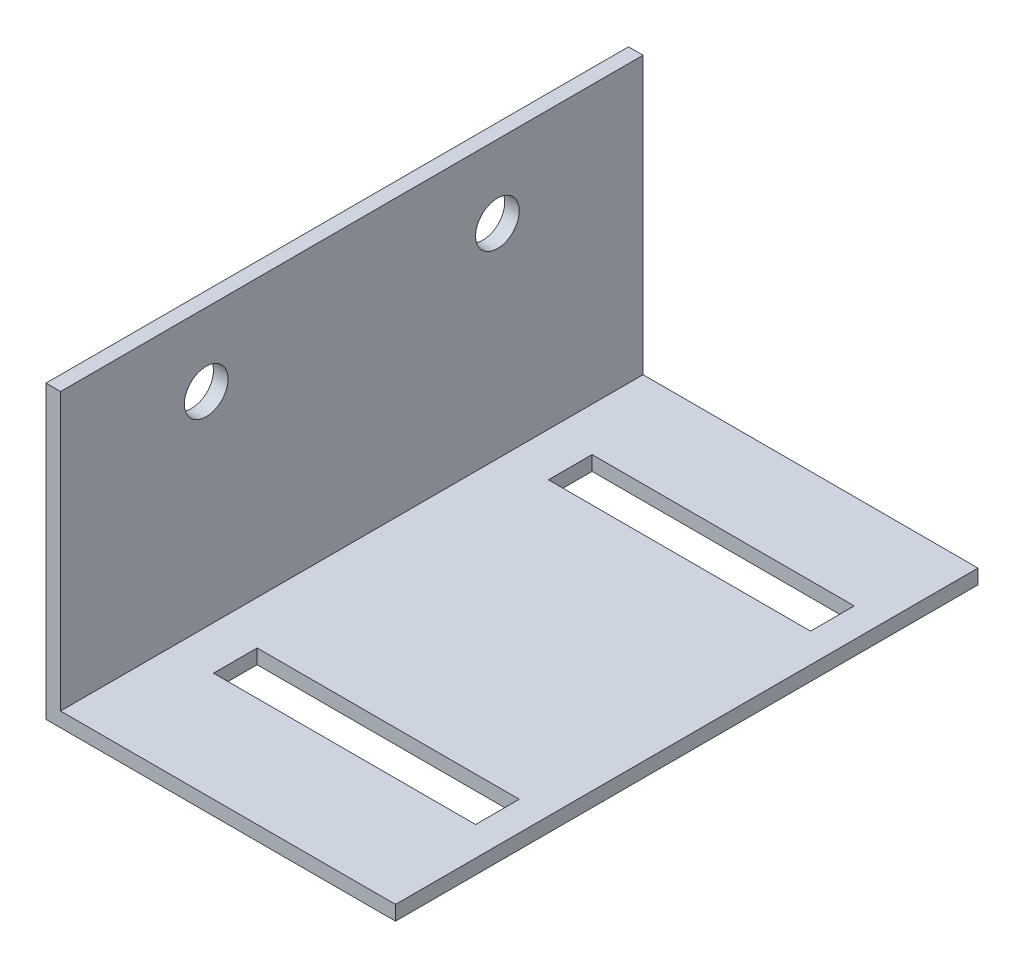
ISO-10303-21;
HEADER;
FILE_DESCRIPTION(('STEP AP214'),'2;1');
FILE_NAME('part.step','',(''),(''),'','','');
FILE_SCHEMA(('AUTOMOTIVE_DESIGN { 1 0 10303 214 1 1 1 1 }'));
ENDSEC;
DATA;
#1=APPLICATION_CONTEXT('core data for automotive mechanical design processes');
#2=APPLICATION_PROTOCOL_DEFINITION('international standard','automotive_design',2000,#1);
#3=PRODUCT_CONTEXT('',#1,'mechanical');
#4=PRODUCT('Part','Part','',(#3));
#5=PRODUCT_RELATED_PRODUCT_CATEGORY('part','',(#4));
#6=PRODUCT_DEFINITION_FORMATION('','',#4);
#7=PRODUCT_DEFINITION_CONTEXT('part definition',#1,'design');
#8=PRODUCT_DEFINITION('design','',#6,#7);
#9=PRODUCT_DEFINITION_SHAPE('','',#8);
#10=(LENGTH_UNIT() NAMED_UNIT(*) SI_UNIT(.MILLI.,.METRE.));
#11=(NAMED_UNIT(*) PLANE_ANGLE_UNIT() SI_UNIT($,.RADIAN.));
#12=(NAMED_UNIT(*) SI_UNIT($,.STERADIAN.) SOLID_ANGLE_UNIT());
#13=UNCERTAINTY_MEASURE_WITH_UNIT(LENGTH_MEASURE(1.E-05),#10,'distance_accuracy_value','');
#14=(GEOMETRIC_REPRESENTATION_CONTEXT(3) GLOBAL_UNCERTAINTY_ASSIGNED_CONTEXT((#13)) GLOBAL_UNIT_ASSIGNED_CONTEXT((#10,
#11,#12)) REPRESENTATION_CONTEXT('',''));
#15=CARTESIAN_POINT('',(0.,0.,0.));
#16=DIRECTION('',(0.,0.,1.));
#17=DIRECTION('',(1.,0.,0.));
#18=AXIS2_PLACEMENT_3D('',#15,#16,#17);
#19=CARTESIAN_POINT('',(0.,20.,40.));
#20=DIRECTION('',(1.,0.,0.));
#21=DIRECTION('',(0.,1.,0.));
#22=AXIS2_PLACEMENT_3D('',#19,#20,#21);
#23=PLANE('',#22);
#24=CARTESIAN_POINT('',(0.,15.,30.));
#25=DIRECTION('',(-1.,0.,0.));
#26=DIRECTION('',(0.,-1.,0.));
#27=AXIS2_PLACEMENT_3D('',#24,#25,#26);
#28=CIRCLE('',#27,1.5);
#29=CARTESIAN_POINT('',(0.,13.5,30.));
#30=VERTEX_POINT('',#29);
#31=EDGE_CURVE('E249',#30,#30,#28,.T.);
#32=ORIENTED_EDGE('',*,*,#31,.F.);
#33=EDGE_LOOP('',(#32));
#34=FACE_BOUND('',#33,.T.);
#35=CARTESIAN_POINT('',(0.,15.,10.));
#36=DIRECTION('',(-1.,0.,0.));
#37=DIRECTION('',(0.,-1.,0.));
#38=AXIS2_PLACEMENT_3D('',#35,#36,#37);
#39=CIRCLE('',#38,1.5);
#40=CARTESIAN_POINT('',(0.,13.5,10.));
#41=VERTEX_POINT('',#40);
#42=EDGE_CURVE('E254',#41,#41,#39,.T.);
#43=ORIENTED_EDGE('',*,*,#42,.F.);
#44=EDGE_LOOP('',(#43));
#45=FACE_BOUND('',#44,.T.);
#46=DIRECTION('',(0.,-1.,0.));
#47=VECTOR('',#46,1.);
#48=CARTESIAN_POINT('',(0.,20.,0.));
#49=LINE('',#48,#47);
#50=CARTESIAN_POINT('',(0.,20.,0.));
#51=VERTEX_POINT('',#50);
#52=CARTESIAN_POINT('',(0.,0.,0.));
#53=VERTEX_POINT('',#52);
#54=EDGE_CURVE('E208',#51,#53,#49,.T.);
#55=ORIENTED_EDGE('',*,*,#54,.T.);
#56=DIRECTION('',(0.,0.,-1.));
#57=VECTOR('',#56,1.);
#58=CARTESIAN_POINT('',(0.,0.,40.));
#59=LINE('',#58,#57);
#60=CARTESIAN_POINT('',(0.,0.,40.));
#61=VERTEX_POINT('',#60);
#62=EDGE_CURVE('E11',#61,#53,#59,.T.);
#63=ORIENTED_EDGE('',*,*,#62,.F.);
#64=DIRECTION('',(0.,-1.,0.));
#65=VECTOR('',#64,1.);
#66=CARTESIAN_POINT('',(0.,20.,40.));
#67=LINE('',#66,#65);
#68=CARTESIAN_POINT('',(0.,20.,40.));
#69=VERTEX_POINT('',#68);
#70=EDGE_CURVE('E209',#69,#61,#67,.T.);
#71=ORIENTED_EDGE('',*,*,#70,.F.);
#72=DIRECTION('',(0.,0.,-1.));
#73=VECTOR('',#72,1.);
#74=CARTESIAN_POINT('',(0.,20.,40.));
#75=LINE('',#74,#73);
#76=EDGE_CURVE('E223',#69,#51,#75,.T.);
#77=ORIENTED_EDGE('',*,*,#76,.T.);
#78=EDGE_LOOP('',(#55,#63,#71,#77));
#79=FACE_BOUND('',#78,.T.);
#80=ADVANCED_FACE('F36',(#34,#45,#79),#23,.F.);
#81=CARTESIAN_POINT('',(0.,0.,40.));
#82=DIRECTION('',(0.,1.,0.));
#83=DIRECTION('',(0.,0.,1.));
#84=AXIS2_PLACEMENT_3D('',#81,#82,#83);
#85=PLANE('',#84);
#86=DIRECTION('',(-1.,0.,0.));
#87=VECTOR('',#86,1.);
#88=CARTESIAN_POINT('',(0.,0.,6.50000000000001));
#89=LINE('',#88,#87);
#90=CARTESIAN_POINT('',(22.,0.,6.50000000000001));
#91=VERTEX_POINT('',#90);
#92=CARTESIAN_POINT('',(4.00000000000001,0.,6.50000000000001));
#93=VERTEX_POINT('',#92);
#94=EDGE_CURVE('E202',#91,#93,#89,.T.);
#95=ORIENTED_EDGE('',*,*,#94,.T.);
#96=DIRECTION('',(0.,0.,1.));
#97=VECTOR('',#96,1.);
#98=CARTESIAN_POINT('',(4.00000000000003,0.,40.));
#99=LINE('',#98,#97);
#100=CARTESIAN_POINT('',(4.00000000000001,0.,9.50000000000001));
#101=VERTEX_POINT('',#100);
#102=EDGE_CURVE('E205',#93,#101,#99,.T.);
#103=ORIENTED_EDGE('',*,*,#102,.T.);
#104=DIRECTION('',(1.,0.,0.));
#105=VECTOR('',#104,1.);
#106=CARTESIAN_POINT('',(0.,0.,9.50000000000002));
#107=LINE('',#106,#105);
#108=CARTESIAN_POINT('',(22.,0.,9.50000000000002));
#109=VERTEX_POINT('',#108);
#110=EDGE_CURVE('E199',#101,#109,#107,.T.);
#111=ORIENTED_EDGE('',*,*,#110,.T.);
#112=DIRECTION('',(0.,0.,-1.));
#113=VECTOR('',#112,1.);
#114=CARTESIAN_POINT('',(22.,0.,40.));
#115=LINE('',#114,#113);
#116=EDGE_CURVE('E143',#109,#91,#115,.T.);
#117=ORIENTED_EDGE('',*,*,#116,.T.);
#118=EDGE_LOOP('',(#95,#103,#111,#117));
#119=FACE_BOUND('',#118,.T.);
#120=DIRECTION('',(-1.,0.,0.));
#121=VECTOR('',#120,1.);
#122=CARTESIAN_POINT('',(0.,0.,29.5));
#123=LINE('',#122,#121);
#124=CARTESIAN_POINT('',(22.,0.,29.5));
#125=VERTEX_POINT('',#124);
#126=CARTESIAN_POINT('',(4.00000000000001,0.,29.5));
#127=VERTEX_POINT('',#126);
#128=EDGE_CURVE('E193',#125,#127,#123,.T.);
#129=ORIENTED_EDGE('',*,*,#128,.T.);
#130=DIRECTION('',(0.,0.,1.));
#131=VECTOR('',#130,1.);
#132=CARTESIAN_POINT('',(4.00000000000001,0.,40.));
#133=LINE('',#132,#131);
#134=CARTESIAN_POINT('',(4.00000000000001,0.,32.5));
#135=VERTEX_POINT('',#134);
#136=EDGE_CURVE('E196',#127,#135,#133,.T.);
#137=ORIENTED_EDGE('',*,*,#136,.T.);
#138=DIRECTION('',(1.,0.,0.));
#139=VECTOR('',#138,1.);
#140=CARTESIAN_POINT('',(0.,0.,32.5));
#141=LINE('',#140,#139);
#142=CARTESIAN_POINT('',(22.,0.,32.5));
#143=VERTEX_POINT('',#142);
#144=EDGE_CURVE('E167',#135,#143,#141,.T.);
#145=ORIENTED_EDGE('',*,*,#144,.T.);
#146=DIRECTION('',(0.,0.,-1.));
#147=VECTOR('',#146,1.);
#148=CARTESIAN_POINT('',(22.,0.,40.));
#149=LINE('',#148,#147);
#150=EDGE_CURVE('E190',#143,#125,#149,.T.);
#151=ORIENTED_EDGE('',*,*,#150,.T.);
#152=EDGE_LOOP('',(#129,#137,#145,#151));
#153=FACE_BOUND('',#152,.T.);
#154=DIRECTION('',(1.,0.,0.));
#155=VECTOR('',#154,1.);
#156=CARTESIAN_POINT('',(0.,0.,0.));
#157=LINE('',#156,#155);
#158=CARTESIAN_POINT('',(24.,0.,0.));
#159=VERTEX_POINT('',#158);
#160=EDGE_CURVE('E226',#53,#159,#157,.T.);
#161=ORIENTED_EDGE('',*,*,#160,.T.);
#162=DIRECTION('',(0.,0.,-1.));
#163=VECTOR('',#162,1.);
#164=CARTESIAN_POINT('',(24.,0.,40.));
#165=LINE('',#164,#163);
#166=CARTESIAN_POINT('',(24.,0.,40.));
#167=VERTEX_POINT('',#166);
#168=EDGE_CURVE('E44',#167,#159,#165,.T.);
#169=ORIENTED_EDGE('',*,*,#168,.F.);
#170=DIRECTION('',(1.,0.,0.));
#171=VECTOR('',#170,1.);
#172=CARTESIAN_POINT('',(0.,0.,40.));
#173=LINE('',#172,#171);
#174=EDGE_CURVE('E212',#61,#167,#173,.T.);
#175=ORIENTED_EDGE('',*,*,#174,.F.);
#176=ORIENTED_EDGE('',*,*,#62,.T.);
#177=EDGE_LOOP('',(#161,#169,#175,#176));
#178=FACE_BOUND('',#177,.T.);
#179=ADVANCED_FACE('F266',(#119,#153,#178),#85,.F.);
#180=CARTESIAN_POINT('',(24.,0.,40.));
#181=DIRECTION('',(-1.,0.,0.));
#182=DIRECTION('',(0.,0.,1.));
#183=AXIS2_PLACEMENT_3D('',#180,#181,#182);
#184=PLANE('',#183);
#185=DIRECTION('',(0.,1.,0.));
#186=VECTOR('',#185,1.);
#187=CARTESIAN_POINT('',(24.,0.,0.));
#188=LINE('',#187,#186);
#189=CARTESIAN_POINT('',(24.,0.999999999999995,0.));
#190=VERTEX_POINT('',#189);
#191=EDGE_CURVE('E228',#159,#190,#188,.T.);
#192=ORIENTED_EDGE('',*,*,#191,.T.);
#193=DIRECTION('',(0.,0.,-1.));
#194=VECTOR('',#193,1.);
#195=CARTESIAN_POINT('',(24.,0.999999999999995,40.));
#196=LINE('',#195,#194);
#197=CARTESIAN_POINT('',(24.,0.999999999999995,40.));
#198=VERTEX_POINT('',#197);
#199=EDGE_CURVE('E243',#198,#190,#196,.T.);
#200=ORIENTED_EDGE('',*,*,#199,.F.);
#201=DIRECTION('',(0.,1.,0.));
#202=VECTOR('',#201,1.);
#203=CARTESIAN_POINT('',(24.,0.,40.));
#204=LINE('',#203,#202);
#205=EDGE_CURVE('E215',#167,#198,#204,.T.);
#206=ORIENTED_EDGE('',*,*,#205,.F.);
#207=ORIENTED_EDGE('',*,*,#168,.T.);
#208=EDGE_LOOP('',(#192,#200,#206,#207));
#209=FACE_BOUND('',#208,.T.);
#210=ADVANCED_FACE('F269',(#209),#184,.F.);
#211=CARTESIAN_POINT('',(24.,0.999999999999995,40.));
#212=DIRECTION('',(0.,-1.,0.));
#213=DIRECTION('',(1.,0.,0.));
#214=AXIS2_PLACEMENT_3D('',#211,#212,#213);
#215=PLANE('',#214);
#216=DIRECTION('',(1.,0.,0.));
#217=VECTOR('',#216,1.);
#218=CARTESIAN_POINT('',(4.00000000000001,1.,9.50000000000001));
#219=LINE('',#218,#217);
#220=CARTESIAN_POINT('',(4.00000000000001,0.999999999999999,9.50000000000002));
#221=VERTEX_POINT('',#220);
#222=CARTESIAN_POINT('',(22.,1.,9.50000000000002));
#223=VERTEX_POINT('',#222);
#224=EDGE_CURVE('E150',#221,#223,#219,.T.);
#225=ORIENTED_EDGE('',*,*,#224,.F.);
#226=DIRECTION('',(0.,0.,1.));
#227=VECTOR('',#226,1.);
#228=CARTESIAN_POINT('',(4.00000000000001,1.,6.50000000000001));
#229=LINE('',#228,#227);
#230=CARTESIAN_POINT('',(4.00000000000001,1.,6.50000000000001));
#231=VERTEX_POINT('',#230);
#232=EDGE_CURVE('E155',#231,#221,#229,.T.);
#233=ORIENTED_EDGE('',*,*,#232,.F.);
#234=DIRECTION('',(-1.,0.,0.));
#235=VECTOR('',#234,1.);
#236=CARTESIAN_POINT('',(4.00000000000001,1.,6.50000000000001));
#237=LINE('',#236,#235);
#238=CARTESIAN_POINT('',(22.,1.,6.50000000000001));
#239=VERTEX_POINT('',#238);
#240=EDGE_CURVE('E160',#239,#231,#237,.T.);
#241=ORIENTED_EDGE('',*,*,#240,.F.);
#242=DIRECTION('',(0.,0.,-1.));
#243=VECTOR('',#242,1.);
#244=CARTESIAN_POINT('',(22.,1.,6.50000000000001));
#245=LINE('',#244,#243);
#246=EDGE_CURVE('E140',#223,#239,#245,.T.);
#247=ORIENTED_EDGE('',*,*,#246,.F.);
#248=EDGE_LOOP('',(#225,#233,#241,#247));
#249=FACE_BOUND('',#248,.T.);
#250=DIRECTION('',(1.,0.,0.));
#251=VECTOR('',#250,1.);
#252=CARTESIAN_POINT('',(4.00000000000001,1.,32.5));
#253=LINE('',#252,#251);
#254=CARTESIAN_POINT('',(4.00000000000001,0.999999999999999,32.5));
#255=VERTEX_POINT('',#254);
#256=CARTESIAN_POINT('',(22.,1.,32.5));
#257=VERTEX_POINT('',#256);
#258=EDGE_CURVE('E172',#255,#257,#253,.T.);
#259=ORIENTED_EDGE('',*,*,#258,.F.);
#260=DIRECTION('',(0.,0.,1.));
#261=VECTOR('',#260,1.);
#262=CARTESIAN_POINT('',(4.00000000000001,1.,32.5));
#263=LINE('',#262,#261);
#264=CARTESIAN_POINT('',(4.00000000000001,1.,29.5));
#265=VERTEX_POINT('',#264);
#266=EDGE_CURVE('E170',#265,#255,#263,.T.);
#267=ORIENTED_EDGE('',*,*,#266,.F.);
#268=DIRECTION('',(-1.,0.,0.));
#269=VECTOR('',#268,1.);
#270=CARTESIAN_POINT('',(4.00000000000001,1.,29.5));
#271=LINE('',#270,#269);
#272=CARTESIAN_POINT('',(22.,1.,29.5));
#273=VERTEX_POINT('',#272);
#274=EDGE_CURVE('E177',#273,#265,#271,.T.);
#275=ORIENTED_EDGE('',*,*,#274,.F.);
#276=DIRECTION('',(0.,0.,-1.));
#277=VECTOR('',#276,1.);
#278=CARTESIAN_POINT('',(22.,1.,32.5));
#279=LINE('',#278,#277);
#280=EDGE_CURVE('E174',#257,#273,#279,.T.);
#281=ORIENTED_EDGE('',*,*,#280,.F.);
#282=EDGE_LOOP('',(#259,#267,#275,#281));
#283=FACE_BOUND('',#282,.T.);
#284=DIRECTION('',(-1.,0.,0.));
#285=VECTOR('',#284,1.);
#286=CARTESIAN_POINT('',(24.,0.999999999999995,0.));
#287=LINE('',#286,#285);
#288=CARTESIAN_POINT('',(1.00000000000001,1.,0.));
#289=VERTEX_POINT('',#288);
#290=EDGE_CURVE('E230',#190,#289,#287,.T.);
#291=ORIENTED_EDGE('',*,*,#290,.T.);
#292=DIRECTION('',(0.,0.,-1.));
#293=VECTOR('',#292,1.);
#294=CARTESIAN_POINT('',(1.00000000000001,1.,40.));
#295=LINE('',#294,#293);
#296=CARTESIAN_POINT('',(1.00000000000001,1.,40.));
#297=VERTEX_POINT('',#296);
#298=EDGE_CURVE('E240',#297,#289,#295,.T.);
#299=ORIENTED_EDGE('',*,*,#298,.F.);
#300=DIRECTION('',(-1.,0.,0.));
#301=VECTOR('',#300,1.);
#302=CARTESIAN_POINT('',(24.,0.999999999999995,40.));
#303=LINE('',#302,#301);
#304=EDGE_CURVE('E217',#198,#297,#303,.T.);
#305=ORIENTED_EDGE('',*,*,#304,.F.);
#306=ORIENTED_EDGE('',*,*,#199,.T.);
#307=EDGE_LOOP('',(#291,#299,#305,#306));
#308=FACE_BOUND('',#307,.T.);
#309=ADVANCED_FACE('F157',(#249,#283,#308),#215,.F.);
#310=CARTESIAN_POINT('',(1.00000000000001,1.,40.));
#311=DIRECTION('',(-1.,0.,0.));
#312=DIRECTION('',(0.,-1.,0.));
#313=AXIS2_PLACEMENT_3D('',#310,#311,#312);
#314=PLANE('',#313);
#315=CARTESIAN_POINT('',(1.00000000000001,15.,30.));
#316=DIRECTION('',(-1.,0.,0.));
#317=DIRECTION('',(0.,-1.,0.));
#318=AXIS2_PLACEMENT_3D('',#315,#316,#317);
#319=CIRCLE('',#318,1.5);
#320=CARTESIAN_POINT('',(1.00000000000001,13.5,30.));
#321=VERTEX_POINT('',#320);
#322=EDGE_CURVE('E39',#321,#321,#319,.T.);
#323=ORIENTED_EDGE('',*,*,#322,.T.);
#324=EDGE_LOOP('',(#323));
#325=FACE_BOUND('',#324,.T.);
#326=CARTESIAN_POINT('',(1.00000000000001,15.,10.));
#327=DIRECTION('',(-1.,0.,0.));
#328=DIRECTION('',(0.,-1.,0.));
#329=AXIS2_PLACEMENT_3D('',#326,#327,#328);
#330=CIRCLE('',#329,1.5);
#331=CARTESIAN_POINT('',(1.00000000000001,13.5,10.));
#332=VERTEX_POINT('',#331);
#333=EDGE_CURVE('E247',#332,#332,#330,.T.);
#334=ORIENTED_EDGE('',*,*,#333,.T.);
#335=EDGE_LOOP('',(#334));
#336=FACE_BOUND('',#335,.T.);
#337=DIRECTION('',(0.,1.,0.));
#338=VECTOR('',#337,1.);
#339=CARTESIAN_POINT('',(1.00000000000001,1.,0.));
#340=LINE('',#339,#338);
#341=CARTESIAN_POINT('',(1.00000000000001,20.,0.));
#342=VERTEX_POINT('',#341);
#343=EDGE_CURVE('E232',#289,#342,#340,.T.);
#344=ORIENTED_EDGE('',*,*,#343,.T.);
#345=DIRECTION('',(0.,0.,-1.));
#346=VECTOR('',#345,1.);
#347=CARTESIAN_POINT('',(1.00000000000001,20.,40.));
#348=LINE('',#347,#346);
#349=CARTESIAN_POINT('',(1.00000000000001,20.,40.));
#350=VERTEX_POINT('',#349);
#351=EDGE_CURVE('E237',#350,#342,#348,.T.);
#352=ORIENTED_EDGE('',*,*,#351,.F.);
#353=DIRECTION('',(0.,1.,0.));
#354=VECTOR('',#353,1.);
#355=CARTESIAN_POINT('',(1.00000000000001,1.,40.));
#356=LINE('',#355,#354);
#357=EDGE_CURVE('E219',#297,#350,#356,.T.);
#358=ORIENTED_EDGE('',*,*,#357,.F.);
#359=ORIENTED_EDGE('',*,*,#298,.T.);
#360=EDGE_LOOP('',(#344,#352,#358,#359));
#361=FACE_BOUND('',#360,.T.);
#362=ADVANCED_FACE('F288',(#325,#336,#361),#314,.F.);
#363=CARTESIAN_POINT('',(1.00000000000001,20.,40.));
#364=DIRECTION('',(0.,-1.,0.));
#365=DIRECTION('',(0.,0.,-1.));
#366=AXIS2_PLACEMENT_3D('',#363,#364,#365);
#367=PLANE('',#366);
#368=DIRECTION('',(-1.,0.,0.));
#369=VECTOR('',#368,1.);
#370=CARTESIAN_POINT('',(1.00000000000001,20.,0.));
#371=LINE('',#370,#369);
#372=EDGE_CURVE('E213',#342,#51,#371,.T.);
#373=ORIENTED_EDGE('',*,*,#372,.T.);
#374=ORIENTED_EDGE('',*,*,#76,.F.);
#375=DIRECTION('',(-1.,0.,0.));
#376=VECTOR('',#375,1.);
#377=CARTESIAN_POINT('',(1.00000000000001,20.,40.));
#378=LINE('',#377,#376);
#379=EDGE_CURVE('E221',#350,#69,#378,.T.);
#380=ORIENTED_EDGE('',*,*,#379,.F.);
#381=ORIENTED_EDGE('',*,*,#351,.T.);
#382=EDGE_LOOP('',(#373,#374,#380,#381));
#383=FACE_BOUND('',#382,.T.);
#384=ADVANCED_FACE('F297',(#383),#367,.F.);
#385=CARTESIAN_POINT('',(0.,0.,40.));
#386=DIRECTION('',(0.,0.,1.));
#387=DIRECTION('',(1.,0.,0.));
#388=AXIS2_PLACEMENT_3D('',#385,#386,#387);
#389=PLANE('',#388);
#390=ORIENTED_EDGE('',*,*,#70,.T.);
#391=ORIENTED_EDGE('',*,*,#174,.T.);
#392=ORIENTED_EDGE('',*,*,#205,.T.);
#393=ORIENTED_EDGE('',*,*,#304,.T.);
#394=ORIENTED_EDGE('',*,*,#357,.T.);
#395=ORIENTED_EDGE('',*,*,#379,.T.);
#396=EDGE_LOOP('',(#390,#391,#392,#393,#394,#395));
#397=FACE_BOUND('',#396,.T.);
#398=ADVANCED_FACE('F292',(#397),#389,.T.);
#399=CARTESIAN_POINT('',(0.,0.,0.));
#400=DIRECTION('',(0.,0.,1.));
#401=DIRECTION('',(1.,0.,0.));
#402=AXIS2_PLACEMENT_3D('',#399,#400,#401);
#403=PLANE('',#402);
#404=ORIENTED_EDGE('',*,*,#54,.F.);
#405=ORIENTED_EDGE('',*,*,#372,.F.);
#406=ORIENTED_EDGE('',*,*,#343,.F.);
#407=ORIENTED_EDGE('',*,*,#290,.F.);
#408=ORIENTED_EDGE('',*,*,#191,.F.);
#409=ORIENTED_EDGE('',*,*,#160,.F.);
#410=EDGE_LOOP('',(#404,#405,#406,#407,#408,#409));
#411=FACE_BOUND('',#410,.T.);
#412=ADVANCED_FACE('F280',(#411),#403,.F.);
#413=CARTESIAN_POINT('',(4.00000000000001,-9.,32.5));
#414=DIRECTION('',(-1.,0.,0.));
#415=DIRECTION('',(0.,0.,1.));
#416=AXIS2_PLACEMENT_3D('',#413,#414,#415);
#417=PLANE('',#416);
#418=DIRECTION('',(0.,1.,0.));
#419=VECTOR('',#418,1.);
#420=CARTESIAN_POINT('',(4.00000000000001,-9.,29.5));
#421=LINE('',#420,#419);
#422=EDGE_CURVE('E181',#127,#265,#421,.T.);
#423=ORIENTED_EDGE('',*,*,#422,.T.);
#424=ORIENTED_EDGE('',*,*,#266,.T.);
#425=DIRECTION('',(0.,1.,0.));
#426=VECTOR('',#425,1.);
#427=CARTESIAN_POINT('',(4.00000000000001,-9.,32.5));
#428=LINE('',#427,#426);
#429=EDGE_CURVE('E180',#135,#255,#428,.T.);
#430=ORIENTED_EDGE('',*,*,#429,.F.);
#431=ORIENTED_EDGE('',*,*,#136,.F.);
#432=EDGE_LOOP('',(#423,#424,#430,#431));
#433=FACE_BOUND('',#432,.T.);
#434=ADVANCED_FACE('F338',(#433),#417,.F.);
#435=CARTESIAN_POINT('',(4.00000000000001,-9.,29.5));
#436=DIRECTION('',(0.,0.,-1.));
#437=DIRECTION('',(-1.,0.,0.));
#438=AXIS2_PLACEMENT_3D('',#435,#436,#437);
#439=PLANE('',#438);
#440=DIRECTION('',(0.,1.,0.));
#441=VECTOR('',#440,1.);
#442=CARTESIAN_POINT('',(22.,-9.,29.5));
#443=LINE('',#442,#441);
#444=EDGE_CURVE('E183',#125,#273,#443,.T.);
#445=ORIENTED_EDGE('',*,*,#444,.T.);
#446=ORIENTED_EDGE('',*,*,#274,.T.);
#447=ORIENTED_EDGE('',*,*,#422,.F.);
#448=ORIENTED_EDGE('',*,*,#128,.F.);
#449=EDGE_LOOP('',(#445,#446,#447,#448));
#450=FACE_BOUND('',#449,.T.);
#451=ADVANCED_FACE('F334',(#450),#439,.F.);
#452=CARTESIAN_POINT('',(22.,-9.,32.5));
#453=DIRECTION('',(1.,0.,0.));
#454=DIRECTION('',(0.,0.,-1.));
#455=AXIS2_PLACEMENT_3D('',#452,#453,#454);
#456=PLANE('',#455);
#457=DIRECTION('',(0.,1.,0.));
#458=VECTOR('',#457,1.);
#459=CARTESIAN_POINT('',(22.,-9.,32.5));
#460=LINE('',#459,#458);
#461=EDGE_CURVE('E60',#143,#257,#460,.T.);
#462=ORIENTED_EDGE('',*,*,#461,.T.);
#463=ORIENTED_EDGE('',*,*,#280,.T.);
#464=ORIENTED_EDGE('',*,*,#444,.F.);
#465=ORIENTED_EDGE('',*,*,#150,.F.);
#466=EDGE_LOOP('',(#462,#463,#464,#465));
#467=FACE_BOUND('',#466,.T.);
#468=ADVANCED_FACE('F337',(#467),#456,.F.);
#469=CARTESIAN_POINT('',(4.00000000000001,-9.,32.5));
#470=DIRECTION('',(0.,0.,1.));
#471=DIRECTION('',(1.,0.,0.));
#472=AXIS2_PLACEMENT_3D('',#469,#470,#471);
#473=PLANE('',#472);
#474=ORIENTED_EDGE('',*,*,#429,.T.);
#475=ORIENTED_EDGE('',*,*,#258,.T.);
#476=ORIENTED_EDGE('',*,*,#461,.F.);
#477=ORIENTED_EDGE('',*,*,#144,.F.);
#478=EDGE_LOOP('',(#474,#475,#476,#477));
#479=FACE_BOUND('',#478,.T.);
#480=ADVANCED_FACE('F333',(#479),#473,.F.);
#481=CARTESIAN_POINT('',(4.00000000000001,-9.,6.50000000000001));
#482=DIRECTION('',(-1.,0.,0.));
#483=DIRECTION('',(0.,0.,1.));
#484=AXIS2_PLACEMENT_3D('',#481,#482,#483);
#485=PLANE('',#484);
#486=DIRECTION('',(0.,1.,0.));
#487=VECTOR('',#486,1.);
#488=CARTESIAN_POINT('',(4.00000000000001,-9.,6.50000000000001));
#489=LINE('',#488,#487);
#490=EDGE_CURVE('E165',#93,#231,#489,.T.);
#491=ORIENTED_EDGE('',*,*,#490,.T.);
#492=ORIENTED_EDGE('',*,*,#232,.T.);
#493=DIRECTION('',(0.,1.,0.));
#494=VECTOR('',#493,1.);
#495=CARTESIAN_POINT('',(4.00000000000001,-9.,9.50000000000001));
#496=LINE('',#495,#494);
#497=EDGE_CURVE('E146',#101,#221,#496,.T.);
#498=ORIENTED_EDGE('',*,*,#497,.F.);
#499=ORIENTED_EDGE('',*,*,#102,.F.);
#500=EDGE_LOOP('',(#491,#492,#498,#499));
#501=FACE_BOUND('',#500,.T.);
#502=ADVANCED_FACE('F261',(#501),#485,.F.);
#503=CARTESIAN_POINT('',(4.00000000000001,-9.,6.50000000000001));
#504=DIRECTION('',(0.,0.,-1.));
#505=DIRECTION('',(-1.,0.,0.));
#506=AXIS2_PLACEMENT_3D('',#503,#504,#505);
#507=PLANE('',#506);
#508=DIRECTION('',(0.,1.,0.));
#509=VECTOR('',#508,1.);
#510=CARTESIAN_POINT('',(22.,-9.,6.50000000000001));
#511=LINE('',#510,#509);
#512=EDGE_CURVE('E145',#91,#239,#511,.T.);
#513=ORIENTED_EDGE('',*,*,#512,.T.);
#514=ORIENTED_EDGE('',*,*,#240,.T.);
#515=ORIENTED_EDGE('',*,*,#490,.F.);
#516=ORIENTED_EDGE('',*,*,#94,.F.);
#517=EDGE_LOOP('',(#513,#514,#515,#516));
#518=FACE_BOUND('',#517,.T.);
#519=ADVANCED_FACE('F264',(#518),#507,.F.);
#520=CARTESIAN_POINT('',(22.,-9.,6.50000000000001));
#521=DIRECTION('',(1.,0.,0.));
#522=DIRECTION('',(0.,0.,-1.));
#523=AXIS2_PLACEMENT_3D('',#520,#521,#522);
#524=PLANE('',#523);
#525=DIRECTION('',(0.,1.,0.));
#526=VECTOR('',#525,1.);
#527=CARTESIAN_POINT('',(22.,-9.,9.50000000000002));
#528=LINE('',#527,#526);
#529=EDGE_CURVE('E52',#109,#223,#528,.T.);
#530=ORIENTED_EDGE('',*,*,#529,.T.);
#531=ORIENTED_EDGE('',*,*,#246,.T.);
#532=ORIENTED_EDGE('',*,*,#512,.F.);
#533=ORIENTED_EDGE('',*,*,#116,.F.);
#534=EDGE_LOOP('',(#530,#531,#532,#533));
#535=FACE_BOUND('',#534,.T.);
#536=ADVANCED_FACE('F137',(#535),#524,.F.);
#537=CARTESIAN_POINT('',(4.00000000000001,-9.,9.50000000000001));
#538=DIRECTION('',(0.,0.,1.));
#539=DIRECTION('',(1.,0.,0.));
#540=AXIS2_PLACEMENT_3D('',#537,#538,#539);
#541=PLANE('',#540);
#542=ORIENTED_EDGE('',*,*,#497,.T.);
#543=ORIENTED_EDGE('',*,*,#224,.T.);
#544=ORIENTED_EDGE('',*,*,#529,.F.);
#545=ORIENTED_EDGE('',*,*,#110,.F.);
#546=EDGE_LOOP('',(#542,#543,#544,#545));
#547=FACE_BOUND('',#546,.T.);
#548=ADVANCED_FACE('F151',(#547),#541,.F.);
#549=CARTESIAN_POINT('',(10.,15.,10.));
#550=DIRECTION('',(-1.,0.,0.));
#551=DIRECTION('',(0.,-1.,0.));
#552=AXIS2_PLACEMENT_3D('',#549,#550,#551);
#553=CYLINDRICAL_SURFACE('',#552,1.5);
#554=ORIENTED_EDGE('',*,*,#42,.T.);
#555=EDGE_LOOP('',(#554));
#556=FACE_BOUND('',#555,.T.);
#557=ORIENTED_EDGE('',*,*,#333,.F.);
#558=EDGE_LOOP('',(#557));
#559=FACE_BOUND('',#558,.T.);
#560=ADVANCED_FACE('F315',(#556,#559),#553,.F.);
#561=CARTESIAN_POINT('',(10.,15.,30.));
#562=DIRECTION('',(-1.,0.,0.));
#563=DIRECTION('',(0.,-1.,0.));
#564=AXIS2_PLACEMENT_3D('',#561,#562,#563);
#565=CYLINDRICAL_SURFACE('',#564,1.5);
#566=ORIENTED_EDGE('',*,*,#31,.T.);
#567=EDGE_LOOP('',(#566));
#568=FACE_BOUND('',#567,.T.);
#569=ORIENTED_EDGE('',*,*,#322,.F.);
#570=EDGE_LOOP('',(#569));
#571=FACE_BOUND('',#570,.T.);
#572=ADVANCED_FACE('F318',(#568,#571),#565,.F.);
#573=CLOSED_SHELL('',(#80,#179,#210,#309,#362,#384,#398,#412,#434,#451,#468,#480,#502,#519,#536,
#548,#560,#572));
#574=MANIFOLD_SOLID_BREP('B2',#573);
#575=ADVANCED_BREP_SHAPE_REPRESENTATION('',(#18,#574),#14);
#576=SHAPE_DEFINITION_REPRESENTATION(#9,#575);
ENDSEC;
END-ISO-10303-21;
